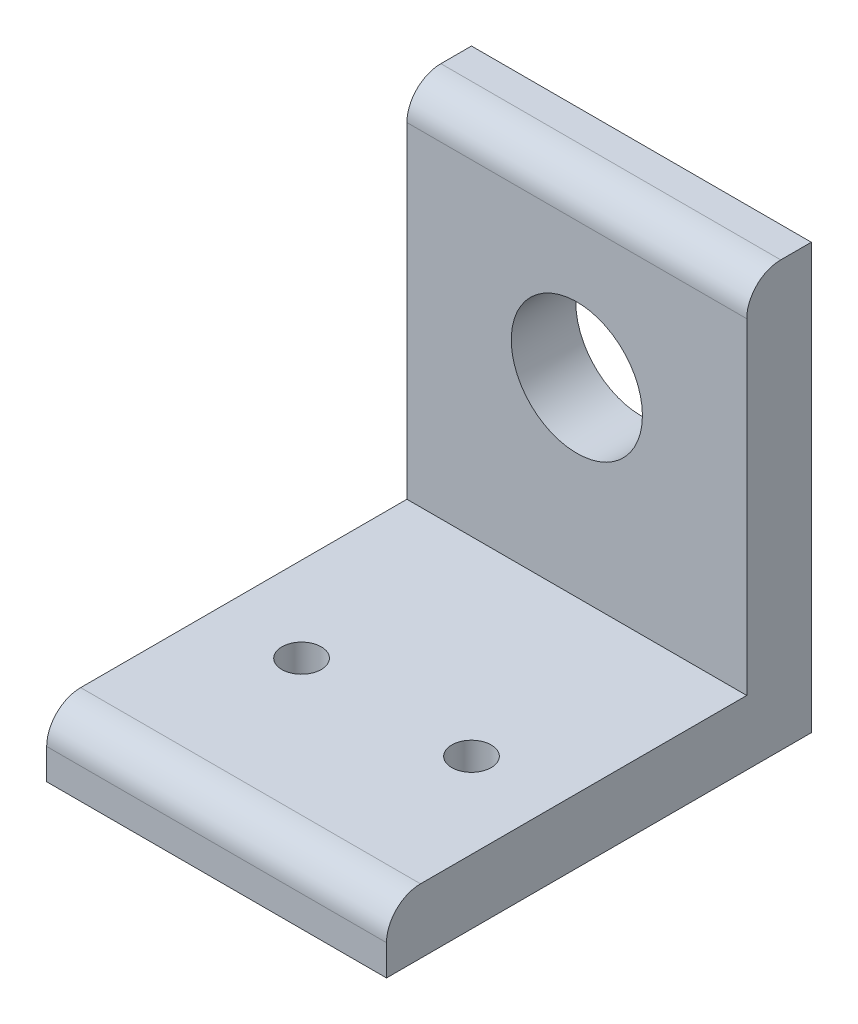
ISO-10303-21;
HEADER;
FILE_DESCRIPTION(('STEP AP214'),'2;1');
FILE_NAME('part.step','',(''),(''),'','','');
FILE_SCHEMA(('AUTOMOTIVE_DESIGN { 1 0 10303 214 1 1 1 1 }'));
ENDSEC;
DATA;
#1=APPLICATION_CONTEXT('core data for automotive mechanical design processes');
#2=APPLICATION_PROTOCOL_DEFINITION('international standard','automotive_design',2000,#1);
#3=PRODUCT_CONTEXT('',#1,'mechanical');
#4=PRODUCT('Part','Part','',(#3));
#5=PRODUCT_RELATED_PRODUCT_CATEGORY('part','',(#4));
#6=PRODUCT_DEFINITION_FORMATION('','',#4);
#7=PRODUCT_DEFINITION_CONTEXT('part definition',#1,'design');
#8=PRODUCT_DEFINITION('design','',#6,#7);
#9=PRODUCT_DEFINITION_SHAPE('','',#8);
#10=(LENGTH_UNIT() NAMED_UNIT(*) SI_UNIT(.MILLI.,.METRE.));
#11=(NAMED_UNIT(*) PLANE_ANGLE_UNIT() SI_UNIT($,.RADIAN.));
#12=(NAMED_UNIT(*) SI_UNIT($,.STERADIAN.) SOLID_ANGLE_UNIT());
#13=UNCERTAINTY_MEASURE_WITH_UNIT(LENGTH_MEASURE(1.E-05),#10,'distance_accuracy_value','');
#14=(GEOMETRIC_REPRESENTATION_CONTEXT(3) GLOBAL_UNCERTAINTY_ASSIGNED_CONTEXT((#13)) GLOBAL_UNIT_ASSIGNED_CONTEXT((#10,
#11,#12)) REPRESENTATION_CONTEXT('',''));
#15=CARTESIAN_POINT('',(0.,0.,0.));
#16=DIRECTION('',(0.,0.,1.));
#17=DIRECTION('',(1.,0.,0.));
#18=AXIS2_PLACEMENT_3D('',#15,#16,#17);
#19=CARTESIAN_POINT('',(-50.8,4.826,0.));
#20=DIRECTION('',(0.,0.,1.));
#21=DIRECTION('',(0.,-1.,0.));
#22=AXIS2_PLACEMENT_3D('',#19,#20,#21);
#23=PLANE('',#22);
#24=DIRECTION('',(0.,-1.,0.));
#25=VECTOR('',#24,1.);
#26=CARTESIAN_POINT('',(-25.4,31.75,0.));
#27=LINE('',#26,#25);
#28=CARTESIAN_POINT('',(-25.4,2.286,0.));
#29=VERTEX_POINT('',#28);
#30=CARTESIAN_POINT('',(-25.4,0.,0.));
#31=VERTEX_POINT('',#30);
#32=EDGE_CURVE('E98',#29,#31,#27,.T.);
#33=ORIENTED_EDGE('',*,*,#32,.F.);
#34=DIRECTION('',(1.,0.,0.));
#35=VECTOR('',#34,1.);
#36=CARTESIAN_POINT('',(-50.8,2.286,0.));
#37=LINE('',#36,#35);
#38=CARTESIAN_POINT('',(-50.8,2.286,0.));
#39=VERTEX_POINT('',#38);
#40=EDGE_CURVE('E146',#29,#39,#37,.F.);
#41=ORIENTED_EDGE('',*,*,#40,.T.);
#42=DIRECTION('',(0.,-1.,0.));
#43=VECTOR('',#42,1.);
#44=CARTESIAN_POINT('',(-50.8,4.826,0.));
#45=LINE('',#44,#43);
#46=CARTESIAN_POINT('',(-50.8,0.,0.));
#47=VERTEX_POINT('',#46);
#48=EDGE_CURVE('E122',#39,#47,#45,.T.);
#49=ORIENTED_EDGE('',*,*,#48,.T.);
#50=DIRECTION('',(1.,0.,0.));
#51=VECTOR('',#50,1.);
#52=CARTESIAN_POINT('',(-50.8,0.,0.));
#53=LINE('',#52,#51);
#54=EDGE_CURVE('E116',#47,#31,#53,.T.);
#55=ORIENTED_EDGE('',*,*,#54,.T.);
#56=EDGE_LOOP('',(#33,#41,#49,#55));
#57=FACE_BOUND('',#56,.T.);
#58=ADVANCED_FACE('F34',(#57),#23,.T.);
#59=CARTESIAN_POINT('',(-50.8,4.826,-26.924));
#60=DIRECTION('',(0.,1.,0.));
#61=DIRECTION('',(0.,0.,1.));
#62=AXIS2_PLACEMENT_3D('',#59,#60,#61);
#63=PLANE('',#62);
#64=DIRECTION('',(0.,0.,1.));
#65=VECTOR('',#64,1.);
#66=CARTESIAN_POINT('',(-25.4,4.826,-26.924));
#67=LINE('',#66,#65);
#68=CARTESIAN_POINT('',(-25.4,4.826,-26.924));
#69=VERTEX_POINT('',#68);
#70=CARTESIAN_POINT('',(-25.4,4.826,-2.54000000000001));
#71=VERTEX_POINT('',#70);
#72=EDGE_CURVE('E191',#69,#71,#67,.T.);
#73=ORIENTED_EDGE('',*,*,#72,.F.);
#74=DIRECTION('',(1.,0.,0.));
#75=VECTOR('',#74,1.);
#76=CARTESIAN_POINT('',(-50.8,4.826,-26.924));
#77=LINE('',#76,#75);
#78=CARTESIAN_POINT('',(-50.8,4.826,-26.924));
#79=VERTEX_POINT('',#78);
#80=EDGE_CURVE('E147',#79,#69,#77,.T.);
#81=ORIENTED_EDGE('',*,*,#80,.F.);
#82=DIRECTION('',(0.,0.,1.));
#83=VECTOR('',#82,1.);
#84=CARTESIAN_POINT('',(-50.8,4.826,-26.924));
#85=LINE('',#84,#83);
#86=CARTESIAN_POINT('',(-50.8,4.826,-2.54000000000001));
#87=VERTEX_POINT('',#86);
#88=EDGE_CURVE('E123',#79,#87,#85,.T.);
#89=ORIENTED_EDGE('',*,*,#88,.T.);
#90=DIRECTION('',(1.,0.,0.));
#91=VECTOR('',#90,1.);
#92=CARTESIAN_POINT('',(-50.8,4.826,-2.54));
#93=LINE('',#92,#91);
#94=EDGE_CURVE('E143',#87,#71,#93,.T.);
#95=ORIENTED_EDGE('',*,*,#94,.T.);
#96=EDGE_LOOP('',(#73,#81,#89,#95));
#97=FACE_BOUND('',#96,.T.);
#98=CARTESIAN_POINT('',(-44.45,4.826,-12.7));
#99=DIRECTION('',(0.,1.,0.));
#100=DIRECTION('',(0.,0.,1.));
#101=AXIS2_PLACEMENT_3D('',#98,#99,#100);
#102=CIRCLE('',#101,1.4732);
#103=CARTESIAN_POINT('',(-44.45,4.826,-11.2268));
#104=VERTEX_POINT('',#103);
#105=EDGE_CURVE('E140',#104,#104,#102,.T.);
#106=ORIENTED_EDGE('',*,*,#105,.F.);
#107=EDGE_LOOP('',(#106));
#108=FACE_BOUND('',#107,.T.);
#109=CARTESIAN_POINT('',(-31.75,4.826,-12.7));
#110=DIRECTION('',(0.,1.,0.));
#111=DIRECTION('',(0.,0.,1.));
#112=AXIS2_PLACEMENT_3D('',#109,#110,#111);
#113=CIRCLE('',#112,1.4732);
#114=CARTESIAN_POINT('',(-31.75,4.826,-11.2268));
#115=VERTEX_POINT('',#114);
#116=EDGE_CURVE('E185',#115,#115,#113,.T.);
#117=ORIENTED_EDGE('',*,*,#116,.F.);
#118=EDGE_LOOP('',(#117));
#119=FACE_BOUND('',#118,.T.);
#120=ADVANCED_FACE('F197',(#97,#108,#119),#63,.T.);
#121=CARTESIAN_POINT('',(-50.8,31.75,-26.924));
#122=DIRECTION('',(0.,0.,1.));
#123=DIRECTION('',(0.,-1.,0.));
#124=AXIS2_PLACEMENT_3D('',#121,#122,#123);
#125=PLANE('',#124);
#126=DIRECTION('',(0.,-1.,0.));
#127=VECTOR('',#126,1.);
#128=CARTESIAN_POINT('',(-25.4,31.75,-26.924));
#129=LINE('',#128,#127);
#130=CARTESIAN_POINT('',(-25.4,29.21,-26.924));
#131=VERTEX_POINT('',#130);
#132=EDGE_CURVE('E119',#131,#69,#129,.T.);
#133=ORIENTED_EDGE('',*,*,#132,.F.);
#134=DIRECTION('',(1.,0.,0.));
#135=VECTOR('',#134,1.);
#136=CARTESIAN_POINT('',(-50.8,29.21,-26.924));
#137=LINE('',#136,#135);
#138=CARTESIAN_POINT('',(-50.8,29.21,-26.924));
#139=VERTEX_POINT('',#138);
#140=EDGE_CURVE('E42',#131,#139,#137,.F.);
#141=ORIENTED_EDGE('',*,*,#140,.T.);
#142=DIRECTION('',(0.,-1.,0.));
#143=VECTOR('',#142,1.);
#144=CARTESIAN_POINT('',(-50.8,31.75,-26.924));
#145=LINE('',#144,#143);
#146=EDGE_CURVE('E128',#139,#79,#145,.T.);
#147=ORIENTED_EDGE('',*,*,#146,.T.);
#148=ORIENTED_EDGE('',*,*,#80,.T.);
#149=EDGE_LOOP('',(#133,#141,#147,#148));
#150=FACE_BOUND('',#149,.T.);
#151=CARTESIAN_POINT('',(-38.1,19.05,-26.924));
#152=DIRECTION('',(0.,0.,1.));
#153=DIRECTION('',(1.,0.,0.));
#154=AXIS2_PLACEMENT_3D('',#151,#152,#153);
#155=CIRCLE('',#154,4.90220000000001);
#156=CARTESIAN_POINT('',(-33.1978,19.05,-26.924));
#157=VERTEX_POINT('',#156);
#158=EDGE_CURVE('E135',#157,#157,#155,.T.);
#159=ORIENTED_EDGE('',*,*,#158,.F.);
#160=EDGE_LOOP('',(#159));
#161=FACE_BOUND('',#160,.T.);
#162=ADVANCED_FACE('F157',(#150,#161),#125,.T.);
#163=CARTESIAN_POINT('',(-50.8,31.75,-31.75));
#164=DIRECTION('',(0.,1.,0.));
#165=DIRECTION('',(0.,0.,1.));
#166=AXIS2_PLACEMENT_3D('',#163,#164,#165);
#167=PLANE('',#166);
#168=DIRECTION('',(0.,0.,1.));
#169=VECTOR('',#168,1.);
#170=CARTESIAN_POINT('',(-25.4,31.75,-31.75));
#171=LINE('',#170,#169);
#172=CARTESIAN_POINT('',(-25.4,31.75,-31.75));
#173=VERTEX_POINT('',#172);
#174=CARTESIAN_POINT('',(-25.4,31.75,-29.464));
#175=VERTEX_POINT('',#174);
#176=EDGE_CURVE('E48',#173,#175,#171,.T.);
#177=ORIENTED_EDGE('',*,*,#176,.F.);
#178=DIRECTION('',(1.,0.,0.));
#179=VECTOR('',#178,1.);
#180=CARTESIAN_POINT('',(-50.8,31.75,-31.75));
#181=LINE('',#180,#179);
#182=CARTESIAN_POINT('',(-50.8,31.75,-31.75));
#183=VERTEX_POINT('',#182);
#184=EDGE_CURVE('E125',#183,#173,#181,.T.);
#185=ORIENTED_EDGE('',*,*,#184,.F.);
#186=DIRECTION('',(0.,0.,1.));
#187=VECTOR('',#186,1.);
#188=CARTESIAN_POINT('',(-50.8,31.75,-31.75));
#189=LINE('',#188,#187);
#190=CARTESIAN_POINT('',(-50.8,31.75,-29.464));
#191=VERTEX_POINT('',#190);
#192=EDGE_CURVE('E164',#183,#191,#189,.T.);
#193=ORIENTED_EDGE('',*,*,#192,.T.);
#194=DIRECTION('',(1.,0.,0.));
#195=VECTOR('',#194,1.);
#196=CARTESIAN_POINT('',(-50.8,31.75,-29.464));
#197=LINE('',#196,#195);
#198=EDGE_CURVE('E152',#191,#175,#197,.T.);
#199=ORIENTED_EDGE('',*,*,#198,.T.);
#200=EDGE_LOOP('',(#177,#185,#193,#199));
#201=FACE_BOUND('',#200,.T.);
#202=ADVANCED_FACE('F168',(#201),#167,.T.);
#203=CARTESIAN_POINT('',(-50.8,0.,-31.75));
#204=DIRECTION('',(0.,0.,-1.));
#205=DIRECTION('',(-1.,0.,0.));
#206=AXIS2_PLACEMENT_3D('',#203,#204,#205);
#207=PLANE('',#206);
#208=DIRECTION('',(0.,-1.,0.));
#209=VECTOR('',#208,1.);
#210=CARTESIAN_POINT('',(-25.4,31.75,-31.75));
#211=LINE('',#210,#209);
#212=CARTESIAN_POINT('',(-25.4,0.,-31.75));
#213=VERTEX_POINT('',#212);
#214=EDGE_CURVE('E108',#173,#213,#211,.T.);
#215=ORIENTED_EDGE('',*,*,#214,.T.);
#216=DIRECTION('',(1.,0.,0.));
#217=VECTOR('',#216,1.);
#218=CARTESIAN_POINT('',(-50.8,0.,-31.75));
#219=LINE('',#218,#217);
#220=CARTESIAN_POINT('',(-50.8,0.,-31.75));
#221=VERTEX_POINT('',#220);
#222=EDGE_CURVE('E118',#221,#213,#219,.T.);
#223=ORIENTED_EDGE('',*,*,#222,.F.);
#224=DIRECTION('',(0.,1.,0.));
#225=VECTOR('',#224,1.);
#226=CARTESIAN_POINT('',(-50.8,0.,-31.75));
#227=LINE('',#226,#225);
#228=EDGE_CURVE('E172',#221,#183,#227,.T.);
#229=ORIENTED_EDGE('',*,*,#228,.T.);
#230=ORIENTED_EDGE('',*,*,#184,.T.);
#231=EDGE_LOOP('',(#215,#223,#229,#230));
#232=FACE_BOUND('',#231,.T.);
#233=CARTESIAN_POINT('',(-38.1,19.05,-31.75));
#234=DIRECTION('',(0.,0.,-1.));
#235=DIRECTION('',(-1.,0.,0.));
#236=AXIS2_PLACEMENT_3D('',#233,#234,#235);
#237=CIRCLE('',#236,4.90220000000001);
#238=CARTESIAN_POINT('',(-43.0022,19.05,-31.75));
#239=VERTEX_POINT('',#238);
#240=EDGE_CURVE('E132',#239,#239,#237,.T.);
#241=ORIENTED_EDGE('',*,*,#240,.F.);
#242=EDGE_LOOP('',(#241));
#243=FACE_BOUND('',#242,.T.);
#244=ADVANCED_FACE('F179',(#232,#243),#207,.T.);
#245=CARTESIAN_POINT('',(-50.8,0.,0.));
#246=DIRECTION('',(0.,-1.,0.));
#247=DIRECTION('',(0.,0.,-1.));
#248=AXIS2_PLACEMENT_3D('',#245,#246,#247);
#249=PLANE('',#248);
#250=DIRECTION('',(0.,0.,1.));
#251=VECTOR('',#250,1.);
#252=CARTESIAN_POINT('',(-25.4,0.,-31.75));
#253=LINE('',#252,#251);
#254=EDGE_CURVE('E101',#213,#31,#253,.T.);
#255=ORIENTED_EDGE('',*,*,#254,.T.);
#256=ORIENTED_EDGE('',*,*,#54,.F.);
#257=DIRECTION('',(0.,0.,-1.));
#258=VECTOR('',#257,1.);
#259=CARTESIAN_POINT('',(-50.8,0.,0.));
#260=LINE('',#259,#258);
#261=EDGE_CURVE('E174',#47,#221,#260,.T.);
#262=ORIENTED_EDGE('',*,*,#261,.T.);
#263=ORIENTED_EDGE('',*,*,#222,.T.);
#264=EDGE_LOOP('',(#255,#256,#262,#263));
#265=FACE_BOUND('',#264,.T.);
#266=CARTESIAN_POINT('',(-44.45,0.,-12.7));
#267=DIRECTION('',(0.,-1.,0.));
#268=DIRECTION('',(0.,0.,-1.));
#269=AXIS2_PLACEMENT_3D('',#266,#267,#268);
#270=CIRCLE('',#269,1.4732);
#271=CARTESIAN_POINT('',(-44.45,0.,-14.1732));
#272=VERTEX_POINT('',#271);
#273=EDGE_CURVE('E139',#272,#272,#270,.T.);
#274=ORIENTED_EDGE('',*,*,#273,.F.);
#275=EDGE_LOOP('',(#274));
#276=FACE_BOUND('',#275,.T.);
#277=CARTESIAN_POINT('',(-31.75,0.,-12.7));
#278=DIRECTION('',(0.,-1.,0.));
#279=DIRECTION('',(0.,0.,-1.));
#280=AXIS2_PLACEMENT_3D('',#277,#278,#279);
#281=CIRCLE('',#280,1.4732);
#282=CARTESIAN_POINT('',(-31.75,0.,-14.1732));
#283=VERTEX_POINT('',#282);
#284=EDGE_CURVE('E136',#283,#283,#281,.T.);
#285=ORIENTED_EDGE('',*,*,#284,.F.);
#286=EDGE_LOOP('',(#285));
#287=FACE_BOUND('',#286,.T.);
#288=ADVANCED_FACE('F113',(#265,#276,#287),#249,.T.);
#289=CARTESIAN_POINT('',(-50.8,0.,0.));
#290=DIRECTION('',(1.,0.,0.));
#291=DIRECTION('',(0.,0.,-1.));
#292=AXIS2_PLACEMENT_3D('',#289,#290,#291);
#293=PLANE('',#292);
#294=ORIENTED_EDGE('',*,*,#48,.F.);
#295=CARTESIAN_POINT('',(-50.8,2.286,-2.54));
#296=DIRECTION('',(1.,0.,0.));
#297=DIRECTION('',(0.,0.,-1.));
#298=AXIS2_PLACEMENT_3D('',#295,#296,#297);
#299=CIRCLE('',#298,2.54);
#300=EDGE_CURVE('E150',#39,#87,#299,.F.);
#301=ORIENTED_EDGE('',*,*,#300,.T.);
#302=ORIENTED_EDGE('',*,*,#88,.F.);
#303=ORIENTED_EDGE('',*,*,#146,.F.);
#304=CARTESIAN_POINT('',(-50.8,29.21,-29.464));
#305=DIRECTION('',(1.,0.,0.));
#306=DIRECTION('',(0.,0.,-1.));
#307=AXIS2_PLACEMENT_3D('',#304,#305,#306);
#308=CIRCLE('',#307,2.54);
#309=EDGE_CURVE('E56',#139,#191,#308,.F.);
#310=ORIENTED_EDGE('',*,*,#309,.T.);
#311=ORIENTED_EDGE('',*,*,#192,.F.);
#312=ORIENTED_EDGE('',*,*,#228,.F.);
#313=ORIENTED_EDGE('',*,*,#261,.F.);
#314=EDGE_LOOP('',(#294,#301,#302,#303,#310,#311,#312,#313));
#315=FACE_BOUND('',#314,.T.);
#316=ADVANCED_FACE('F163',(#315),#293,.F.);
#317=CARTESIAN_POINT('',(-38.1,19.05,-77.724));
#318=DIRECTION('',(0.,0.,1.));
#319=DIRECTION('',(1.,0.,0.));
#320=AXIS2_PLACEMENT_3D('',#317,#318,#319);
#321=CYLINDRICAL_SURFACE('',#320,4.90220000000001);
#322=ORIENTED_EDGE('',*,*,#240,.T.);
#323=EDGE_LOOP('',(#322));
#324=FACE_BOUND('',#323,.T.);
#325=ORIENTED_EDGE('',*,*,#158,.T.);
#326=EDGE_LOOP('',(#325));
#327=FACE_BOUND('',#326,.T.);
#328=ADVANCED_FACE('F229',(#324,#327),#321,.F.);
#329=CARTESIAN_POINT('',(-31.75,-45.974,-12.7));
#330=DIRECTION('',(0.,1.,0.));
#331=DIRECTION('',(0.,0.,1.));
#332=AXIS2_PLACEMENT_3D('',#329,#330,#331);
#333=CYLINDRICAL_SURFACE('',#332,1.4732);
#334=ORIENTED_EDGE('',*,*,#284,.T.);
#335=EDGE_LOOP('',(#334));
#336=FACE_BOUND('',#335,.T.);
#337=ORIENTED_EDGE('',*,*,#116,.T.);
#338=EDGE_LOOP('',(#337));
#339=FACE_BOUND('',#338,.T.);
#340=ADVANCED_FACE('F209',(#336,#339),#333,.F.);
#341=CARTESIAN_POINT('',(-44.45,-45.974,-12.7));
#342=DIRECTION('',(0.,1.,0.));
#343=DIRECTION('',(0.,0.,1.));
#344=AXIS2_PLACEMENT_3D('',#341,#342,#343);
#345=CYLINDRICAL_SURFACE('',#344,1.4732);
#346=ORIENTED_EDGE('',*,*,#273,.T.);
#347=EDGE_LOOP('',(#346));
#348=FACE_BOUND('',#347,.T.);
#349=ORIENTED_EDGE('',*,*,#105,.T.);
#350=EDGE_LOOP('',(#349));
#351=FACE_BOUND('',#350,.T.);
#352=ADVANCED_FACE('F204',(#348,#351),#345,.F.);
#353=CARTESIAN_POINT('',(-50.8,2.286,-2.54));
#354=DIRECTION('',(1.,0.,0.));
#355=DIRECTION('',(0.,0.,-1.));
#356=AXIS2_PLACEMENT_3D('',#353,#354,#355);
#357=CYLINDRICAL_SURFACE('',#356,2.54);
#358=CARTESIAN_POINT('',(-25.4,2.286,-2.54));
#359=DIRECTION('',(-1.,0.,0.));
#360=DIRECTION('',(0.,0.,1.));
#361=AXIS2_PLACEMENT_3D('',#358,#359,#360);
#362=CIRCLE('',#361,2.54);
#363=EDGE_CURVE('E104',#71,#29,#362,.F.);
#364=ORIENTED_EDGE('',*,*,#363,.F.);
#365=ORIENTED_EDGE('',*,*,#94,.F.);
#366=ORIENTED_EDGE('',*,*,#300,.F.);
#367=ORIENTED_EDGE('',*,*,#40,.F.);
#368=EDGE_LOOP('',(#364,#365,#366,#367));
#369=FACE_BOUND('',#368,.T.);
#370=ADVANCED_FACE('F202',(#369),#357,.T.);
#371=CARTESIAN_POINT('',(-50.8,29.21,-29.464));
#372=DIRECTION('',(1.,0.,0.));
#373=DIRECTION('',(0.,0.,-1.));
#374=AXIS2_PLACEMENT_3D('',#371,#372,#373);
#375=CYLINDRICAL_SURFACE('',#374,2.54);
#376=CARTESIAN_POINT('',(-25.4,29.21,-29.464));
#377=DIRECTION('',(-1.,0.,0.));
#378=DIRECTION('',(0.,0.,1.));
#379=AXIS2_PLACEMENT_3D('',#376,#377,#378);
#380=CIRCLE('',#379,2.54);
#381=EDGE_CURVE('E11',#175,#131,#380,.F.);
#382=ORIENTED_EDGE('',*,*,#381,.F.);
#383=ORIENTED_EDGE('',*,*,#198,.F.);
#384=ORIENTED_EDGE('',*,*,#309,.F.);
#385=ORIENTED_EDGE('',*,*,#140,.F.);
#386=EDGE_LOOP('',(#382,#383,#384,#385));
#387=FACE_BOUND('',#386,.T.);
#388=ADVANCED_FACE('F36',(#387),#375,.T.);
#389=CARTESIAN_POINT('',(-25.4,31.75,-31.75));
#390=DIRECTION('',(-1.,0.,0.));
#391=DIRECTION('',(0.,0.,1.));
#392=AXIS2_PLACEMENT_3D('',#389,#390,#391);
#393=PLANE('',#392);
#394=ORIENTED_EDGE('',*,*,#363,.T.);
#395=ORIENTED_EDGE('',*,*,#32,.T.);
#396=ORIENTED_EDGE('',*,*,#254,.F.);
#397=ORIENTED_EDGE('',*,*,#214,.F.);
#398=ORIENTED_EDGE('',*,*,#176,.T.);
#399=ORIENTED_EDGE('',*,*,#381,.T.);
#400=ORIENTED_EDGE('',*,*,#132,.T.);
#401=ORIENTED_EDGE('',*,*,#72,.T.);
#402=EDGE_LOOP('',(#394,#395,#396,#397,#398,#399,#400,#401));
#403=FACE_BOUND('',#402,.T.);
#404=ADVANCED_FACE('F100',(#403),#393,.F.);
#405=CLOSED_SHELL('',(#58,#120,#162,#202,#244,#288,#316,#328,#340,#352,#370,#388,#404));
#406=MANIFOLD_SOLID_BREP('B2',#405);
#407=ADVANCED_BREP_SHAPE_REPRESENTATION('',(#18,#406),#14);
#408=SHAPE_DEFINITION_REPRESENTATION(#9,#407);
ENDSEC;
END-ISO-10303-21;
